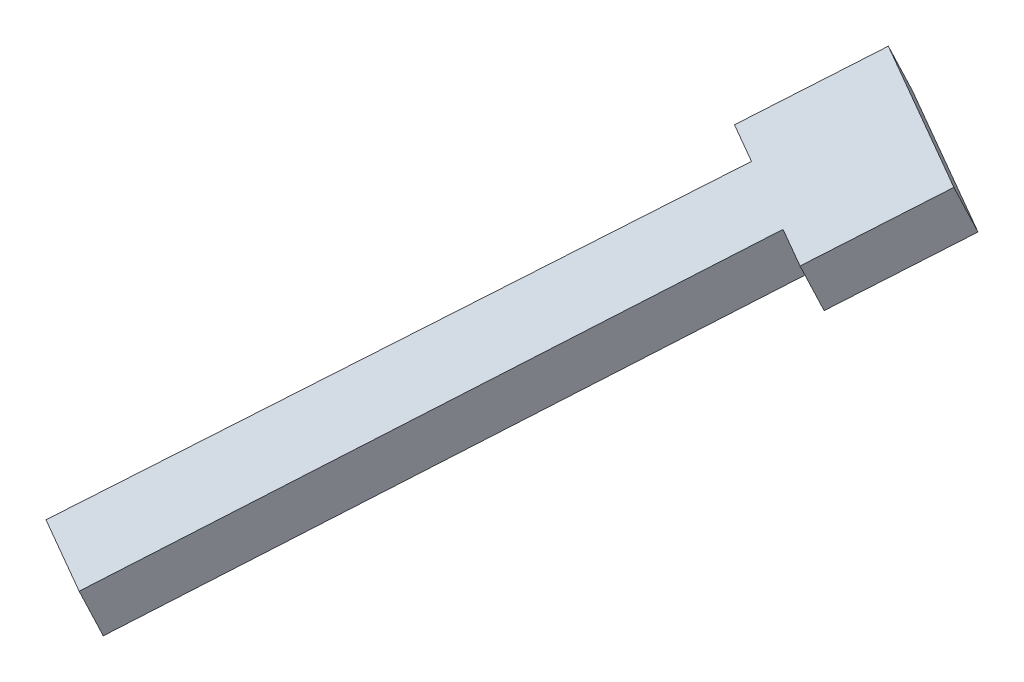
ISO-10303-21;
HEADER;
FILE_DESCRIPTION(('STEP AP214'),'2;1');
FILE_NAME('part.step','',(''),(''),'','','');
FILE_SCHEMA(('AUTOMOTIVE_DESIGN { 1 0 10303 214 1 1 1 1 }'));
ENDSEC;
DATA;
#1=APPLICATION_CONTEXT('core data for automotive mechanical design processes');
#2=APPLICATION_PROTOCOL_DEFINITION('international standard','automotive_design',2000,#1);
#3=PRODUCT_CONTEXT('',#1,'mechanical');
#4=PRODUCT('Part','Part','',(#3));
#5=PRODUCT_RELATED_PRODUCT_CATEGORY('part','',(#4));
#6=PRODUCT_DEFINITION_FORMATION('','',#4);
#7=PRODUCT_DEFINITION_CONTEXT('part definition',#1,'design');
#8=PRODUCT_DEFINITION('design','',#6,#7);
#9=PRODUCT_DEFINITION_SHAPE('','',#8);
#10=(LENGTH_UNIT() NAMED_UNIT(*) SI_UNIT(.MILLI.,.METRE.));
#11=(NAMED_UNIT(*) PLANE_ANGLE_UNIT() SI_UNIT($,.RADIAN.));
#12=(NAMED_UNIT(*) SI_UNIT($,.STERADIAN.) SOLID_ANGLE_UNIT());
#13=UNCERTAINTY_MEASURE_WITH_UNIT(LENGTH_MEASURE(1.E-05),#10,'distance_accuracy_value','');
#14=(GEOMETRIC_REPRESENTATION_CONTEXT(3) GLOBAL_UNCERTAINTY_ASSIGNED_CONTEXT((#13)) GLOBAL_UNIT_ASSIGNED_CONTEXT((#10,
#11,#12)) REPRESENTATION_CONTEXT('',''));
#15=CARTESIAN_POINT('',(0.,0.,0.));
#16=DIRECTION('',(0.,0.,1.));
#17=DIRECTION('',(1.,0.,0.));
#18=AXIS2_PLACEMENT_3D('',#15,#16,#17);
#19=CARTESIAN_POINT('',(-196.842413265264,-205.334128308447,272.802784573492));
#20=DIRECTION('',(-0.866025403782192,0.,-0.500000000003892));
#21=DIRECTION('',(-0.500000000003892,0.,0.866025403782192));
#22=AXIS2_PLACEMENT_3D('',#19,#20,#21);
#23=PLANE('',#22);
#24=DIRECTION('',(0.194220219192644,-0.921473833502283,-0.336399287495333));
#25=VECTOR('',#24,1.);
#26=CARTESIAN_POINT('',(-154.801097182227,-169.889720327231,199.985089101365));
#27=LINE('',#26,#25);
#28=CARTESIAN_POINT('',(-159.907532687323,-145.662342148101,208.829694841675));
#29=VERTEX_POINT('',#28);
#30=CARTESIAN_POINT('',(-159.130651810553,-149.34823748211,207.484097691693));
#31=VERTEX_POINT('',#30);
#32=EDGE_CURVE('E125',#29,#31,#27,.T.);
#33=ORIENTED_EDGE('',*,*,#32,.F.);
#34=DIRECTION('',(-0.460736916754728,-0.388440438382265,0.798019748733539));
#35=VECTOR('',#34,1.);
#36=CARTESIAN_POINT('',(-154.953683261378,-141.485825414326,200.24937594298));
#37=LINE('',#36,#35);
#38=CARTESIAN_POINT('',(-154.953683261378,-141.485825414326,200.24937594298));
#39=VERTEX_POINT('',#38);
#40=EDGE_CURVE('E132',#39,#29,#37,.T.);
#41=ORIENTED_EDGE('',*,*,#40,.F.);
#42=DIRECTION('',(-0.194220219192644,0.921473833502283,0.336399287495333));
#43=VECTOR('',#42,1.);
#44=CARTESIAN_POINT('',(-154.176802384607,-145.171720748335,198.903778792999));
#45=LINE('',#44,#43);
#46=CARTESIAN_POINT('',(-154.176802384607,-145.171720748335,198.903778792999));
#47=VERTEX_POINT('',#46);
#48=EDGE_CURVE('E139',#47,#39,#45,.T.);
#49=ORIENTED_EDGE('',*,*,#48,.F.);
#50=DIRECTION('',(0.460736916754728,0.388440438382265,-0.798019748733539));
#51=VECTOR('',#50,1.);
#52=CARTESIAN_POINT('',(-181.821017389891,-168.478147051271,246.784963717011));
#53=LINE('',#52,#51);
#54=EDGE_CURVE('E144',#31,#47,#53,.T.);
#55=ORIENTED_EDGE('',*,*,#54,.F.);
#56=EDGE_LOOP('',(#33,#41,#49,#55));
#57=FACE_BOUND('',#56,.T.);
#58=ADVANCED_FACE('F33',(#57),#23,.T.);
#59=CARTESIAN_POINT('',(-15.8648390061101,0.,-9.15956907092283));
#60=DIRECTION('',(0.866025403782192,0.,0.500000000003892));
#61=DIRECTION('',(0.500000000003892,0.,-0.866025403782192));
#62=AXIS2_PLACEMENT_3D('',#59,#60,#61);
#63=PLANE('',#62);
#64=DIRECTION('',(-0.194220219192644,0.921473833502283,0.336399287495333));
#65=VECTOR('',#64,1.);
#66=CARTESIAN_POINT('',(-152.660701886479,-115.330556362641,227.777815700641));
#67=LINE('',#66,#65);
#68=CARTESIAN_POINT('',(-145.490751700983,-149.34823748211,215.359097691755));
#69=VERTEX_POINT('',#68);
#70=CARTESIAN_POINT('',(-146.267632577754,-145.662342148101,216.704694841736));
#71=VERTEX_POINT('',#70);
#72=EDGE_CURVE('E102',#69,#71,#67,.T.);
#73=ORIENTED_EDGE('',*,*,#72,.F.);
#74=DIRECTION('',(0.460736916754728,0.388440438382265,-0.798019748733539));
#75=VECTOR('',#74,1.);
#76=CARTESIAN_POINT('',(-168.181117280321,-168.478147051271,254.659963717072));
#77=LINE('',#76,#75);
#78=CARTESIAN_POINT('',(-140.536902275038,-145.171720748335,206.77877879306));
#79=VERTEX_POINT('',#78);
#80=EDGE_CURVE('E130',#69,#79,#77,.T.);
#81=ORIENTED_EDGE('',*,*,#80,.T.);
#82=DIRECTION('',(-0.194220219192644,0.921473833502283,0.336399287495333));
#83=VECTOR('',#82,1.);
#84=CARTESIAN_POINT('',(-140.536902275038,-145.171720748335,206.77877879306));
#85=LINE('',#84,#83);
#86=CARTESIAN_POINT('',(-141.313783151808,-141.485825414326,208.124375943041));
#87=VERTEX_POINT('',#86);
#88=EDGE_CURVE('E129',#79,#87,#85,.T.);
#89=ORIENTED_EDGE('',*,*,#88,.T.);
#90=DIRECTION('',(-0.460736916754728,-0.388440438382265,0.798019748733539));
#91=VECTOR('',#90,1.);
#92=CARTESIAN_POINT('',(-141.313783151808,-141.485825414326,208.124375943041));
#93=LINE('',#92,#91);
#94=EDGE_CURVE('E133',#87,#71,#93,.T.);
#95=ORIENTED_EDGE('',*,*,#94,.T.);
#96=EDGE_LOOP('',(#73,#81,#89,#95));
#97=FACE_BOUND('',#96,.T.);
#98=ADVANCED_FACE('F177',(#97),#63,.T.);
#99=CARTESIAN_POINT('',(-209.448776103503,-141.485825414326,168.786619420739));
#100=DIRECTION('',(-0.194220219192644,0.921473833502283,0.336399287495333));
#101=DIRECTION('',(0.,-0.342929364412348,0.93936119305821));
#102=AXIS2_PLACEMENT_3D('',#99,#100,#101);
#103=PLANE('',#102);
#104=DIRECTION('',(-0.86602540378219,0.,-0.500000000003895));
#105=VECTOR('',#104,1.);
#106=CARTESIAN_POINT('',(-149.80496347495,-145.662342148101,214.662415896006));
#107=LINE('',#106,#105);
#108=CARTESIAN_POINT('',(-149.80496347495,-145.662342148101,214.662415896006));
#109=VERTEX_POINT('',#108);
#110=EDGE_CURVE('E96',#71,#109,#107,.T.);
#111=ORIENTED_EDGE('',*,*,#110,.F.);
#112=ORIENTED_EDGE('',*,*,#94,.F.);
#113=DIRECTION('',(0.866025403782192,0.,0.500000000003892));
#114=VECTOR('',#113,1.);
#115=CARTESIAN_POINT('',(-209.448776103503,-141.485825414326,168.786619420739));
#116=LINE('',#115,#114);
#117=EDGE_CURVE('E142',#39,#87,#116,.T.);
#118=ORIENTED_EDGE('',*,*,#117,.F.);
#119=ORIENTED_EDGE('',*,*,#40,.T.);
#120=DIRECTION('',(-0.866025403782191,0.,-0.500000000003893));
#121=VECTOR('',#120,1.);
#122=CARTESIAN_POINT('',(-156.370201790127,-145.662342148101,210.871973787405));
#123=LINE('',#122,#121);
#124=CARTESIAN_POINT('',(-156.370201790127,-145.662342148101,210.871973787405));
#125=VERTEX_POINT('',#124);
#126=EDGE_CURVE('E121',#125,#29,#123,.T.);
#127=ORIENTED_EDGE('',*,*,#126,.F.);
#128=DIRECTION('',(0.464104841659749,0.388437494912603,-0.796067213552977));
#129=VECTOR('',#128,1.);
#130=CARTESIAN_POINT('',(-179.226604088671,-164.792251717262,250.076978468193));
#131=LINE('',#130,#129);
#132=CARTESIAN_POINT('',(-179.226604088671,-164.792251717262,250.076978468193));
#133=VERTEX_POINT('',#132);
#134=EDGE_CURVE('E118',#133,#125,#131,.T.);
#135=ORIENTED_EDGE('',*,*,#134,.F.);
#136=DIRECTION('',(0.866025403782192,0.,0.500000000003892));
#137=VECTOR('',#136,1.);
#138=CARTESIAN_POINT('',(-237.092991108787,-164.792251717262,216.667804344751));
#139=LINE('',#138,#137);
#140=CARTESIAN_POINT('',(-172.329292335083,-164.792251717262,254.059143265853));
#141=VERTEX_POINT('',#140);
#142=EDGE_CURVE('E115',#133,#141,#139,.T.);
#143=ORIENTED_EDGE('',*,*,#142,.T.);
#144=DIRECTION('',(-0.457362009234086,-0.388437494912604,0.799960189669074));
#145=VECTOR('',#144,1.);
#146=CARTESIAN_POINT('',(-172.329292335083,-164.792251717262,254.059143265853));
#147=LINE('',#146,#145);
#148=EDGE_CURVE('E107',#109,#141,#147,.T.);
#149=ORIENTED_EDGE('',*,*,#148,.F.);
#150=EDGE_LOOP('',(#111,#112,#118,#119,#127,#135,#143,#149));
#151=FACE_BOUND('',#150,.T.);
#152=ADVANCED_FACE('F112',(#151),#103,.T.);
#153=CARTESIAN_POINT('',(-237.092991108787,-164.792251717262,216.667804344751));
#154=DIRECTION('',(-0.460736916754731,-0.388440438382252,0.798019748733544));
#155=DIRECTION('',(0.866025403782191,0.,0.500000000003892));
#156=AXIS2_PLACEMENT_3D('',#153,#154,#155);
#157=PLANE('',#156);
#158=DIRECTION('',(-0.194220219192645,0.921473833502283,0.336399287495333));
#159=VECTOR('',#158,1.);
#160=CARTESIAN_POINT('',(-166.866769743145,-190.709077752728,244.597776599222));
#161=LINE('',#160,#159);
#162=CARTESIAN_POINT('',(-171.552411458312,-168.478147051271,252.713546115872));
#163=VERTEX_POINT('',#162);
#164=EDGE_CURVE('E55',#163,#141,#161,.T.);
#165=ORIENTED_EDGE('',*,*,#164,.T.);
#166=ORIENTED_EDGE('',*,*,#142,.F.);
#167=DIRECTION('',(-0.194220219192645,0.921473833502283,0.336399287495333));
#168=VECTOR('',#167,1.);
#169=CARTESIAN_POINT('',(-173.764081496733,-190.709077752728,240.615611801562));
#170=LINE('',#169,#168);
#171=CARTESIAN_POINT('',(-178.4497232119,-168.478147051271,248.731381318212));
#172=VERTEX_POINT('',#171);
#173=EDGE_CURVE('E123',#172,#133,#170,.T.);
#174=ORIENTED_EDGE('',*,*,#173,.F.);
#175=DIRECTION('',(0.866025403782192,0.,0.500000000003892));
#176=VECTOR('',#175,1.);
#177=CARTESIAN_POINT('',(-236.316110232016,-168.478147051271,215.32220719477));
#178=LINE('',#177,#176);
#179=EDGE_CURVE('E146',#172,#163,#178,.T.);
#180=ORIENTED_EDGE('',*,*,#179,.T.);
#181=EDGE_LOOP('',(#165,#166,#174,#180));
#182=FACE_BOUND('',#181,.T.);
#183=ADVANCED_FACE('F168',(#182),#157,.T.);
#184=CARTESIAN_POINT('',(-236.316110232016,-168.478147051271,215.32220719477));
#185=DIRECTION('',(0.194220219192644,-0.921473833502283,-0.336399287495332));
#186=DIRECTION('',(0.,0.342929364412347,-0.93936119305821));
#187=AXIS2_PLACEMENT_3D('',#184,#185,#186);
#188=PLANE('',#187);
#189=DIRECTION('',(0.86602540378219,0.,0.500000000003895));
#190=VECTOR('',#189,1.);
#191=CARTESIAN_POINT('',(-213.625744652678,-149.34823748211,176.021341169452));
#192=LINE('',#191,#190);
#193=CARTESIAN_POINT('',(-149.028082598179,-149.34823748211,213.316818746024));
#194=VERTEX_POINT('',#193);
#195=EDGE_CURVE('E11',#194,#69,#192,.T.);
#196=ORIENTED_EDGE('',*,*,#195,.F.);
#197=DIRECTION('',(0.457362009234086,0.388437494912603,-0.799960189669075));
#198=VECTOR('',#197,1.);
#199=CARTESIAN_POINT('',(-171.419260946905,-168.365062339263,252.480655962755));
#200=LINE('',#199,#198);
#201=EDGE_CURVE('E40',#163,#194,#200,.T.);
#202=ORIENTED_EDGE('',*,*,#201,.F.);
#203=ORIENTED_EDGE('',*,*,#179,.F.);
#204=DIRECTION('',(-0.464104841659749,-0.388437494912603,0.796067213552977));
#205=VECTOR('',#204,1.);
#206=CARTESIAN_POINT('',(-178.570447200048,-168.579188280154,248.938456100087));
#207=LINE('',#206,#205);
#208=CARTESIAN_POINT('',(-155.593320913357,-149.34823748211,209.526376637423));
#209=VERTEX_POINT('',#208);
#210=EDGE_CURVE('E153',#209,#172,#207,.T.);
#211=ORIENTED_EDGE('',*,*,#210,.F.);
#212=DIRECTION('',(0.866025403782191,0.,0.500000000003893));
#213=VECTOR('',#212,1.);
#214=CARTESIAN_POINT('',(-213.625744652678,-149.34823748211,176.021341169452));
#215=LINE('',#214,#213);
#216=EDGE_CURVE('E155',#31,#209,#215,.T.);
#217=ORIENTED_EDGE('',*,*,#216,.F.);
#218=ORIENTED_EDGE('',*,*,#54,.T.);
#219=DIRECTION('',(0.866025403782192,0.,0.500000000003892));
#220=VECTOR('',#219,1.);
#221=CARTESIAN_POINT('',(-208.671895226732,-145.171720748335,167.441022270758));
#222=LINE('',#221,#220);
#223=EDGE_CURVE('E143',#47,#79,#222,.T.);
#224=ORIENTED_EDGE('',*,*,#223,.T.);
#225=ORIENTED_EDGE('',*,*,#80,.F.);
#226=EDGE_LOOP('',(#196,#202,#203,#211,#217,#218,#224,#225));
#227=FACE_BOUND('',#226,.T.);
#228=ADVANCED_FACE('F164',(#227),#188,.T.);
#229=CARTESIAN_POINT('',(-208.671895226732,-145.171720748335,167.441022270758));
#230=DIRECTION('',(0.460736916754728,0.388440438382265,-0.798019748733539));
#231=DIRECTION('',(-0.866025403782192,0.,-0.500000000003892));
#232=AXIS2_PLACEMENT_3D('',#229,#230,#231);
#233=PLANE('',#232);
#234=ORIENTED_EDGE('',*,*,#223,.F.);
#235=ORIENTED_EDGE('',*,*,#48,.T.);
#236=ORIENTED_EDGE('',*,*,#117,.T.);
#237=ORIENTED_EDGE('',*,*,#88,.F.);
#238=EDGE_LOOP('',(#234,#235,#236,#237));
#239=FACE_BOUND('',#238,.T.);
#240=ADVANCED_FACE('F175',(#239),#233,.T.);
#241=CARTESIAN_POINT('',(-150.907679198189,-171.579168183567,201.410607120773));
#242=DIRECTION('',(0.460736916754729,0.388440438382265,-0.798019748733538));
#243=DIRECTION('',(-0.866025403782191,0.,-0.500000000003893));
#244=AXIS2_PLACEMENT_3D('',#241,#242,#243);
#245=PLANE('',#244);
#246=ORIENTED_EDGE('',*,*,#32,.T.);
#247=ORIENTED_EDGE('',*,*,#216,.T.);
#248=DIRECTION('',(-0.194220219192645,0.921473833502283,0.336399287495333));
#249=VECTOR('',#248,1.);
#250=CARTESIAN_POINT('',(-150.907679198189,-171.579168183567,201.410607120773));
#251=LINE('',#250,#249);
#252=EDGE_CURVE('E47',#209,#125,#251,.T.);
#253=ORIENTED_EDGE('',*,*,#252,.T.);
#254=ORIENTED_EDGE('',*,*,#126,.T.);
#255=EDGE_LOOP('',(#246,#247,#253,#254));
#256=FACE_BOUND('',#255,.T.);
#257=ADVANCED_FACE('F159',(#256),#245,.F.);
#258=CARTESIAN_POINT('',(-173.764081496733,-190.709077752728,240.615611801562));
#259=DIRECTION('',(0.864225203523214,-0.00151218934913683,0.503102882995746));
#260=DIRECTION('',(0.503103458223597,0.,-0.86422619164398));
#261=AXIS2_PLACEMENT_3D('',#258,#259,#260);
#262=PLANE('',#261);
#263=ORIENTED_EDGE('',*,*,#210,.T.);
#264=ORIENTED_EDGE('',*,*,#173,.T.);
#265=ORIENTED_EDGE('',*,*,#134,.T.);
#266=ORIENTED_EDGE('',*,*,#252,.F.);
#267=EDGE_LOOP('',(#263,#264,#265,#266));
#268=FACE_BOUND('',#267,.T.);
#269=ADVANCED_FACE('F166',(#268),#262,.F.);
#270=CARTESIAN_POINT('',(-144.342440883012,-171.579168183567,205.201049229374));
#271=DIRECTION('',(0.460736916754731,0.388440438382265,-0.798019748733537));
#272=DIRECTION('',(-0.86602540378219,0.,-0.500000000003896));
#273=AXIS2_PLACEMENT_3D('',#270,#271,#272);
#274=PLANE('',#273);
#275=ORIENTED_EDGE('',*,*,#72,.T.);
#276=ORIENTED_EDGE('',*,*,#110,.T.);
#277=DIRECTION('',(-0.194220219192645,0.921473833502283,0.336399287495333));
#278=VECTOR('',#277,1.);
#279=CARTESIAN_POINT('',(-144.342440883012,-171.579168183567,205.201049229374));
#280=LINE('',#279,#278);
#281=EDGE_CURVE('E99',#194,#109,#280,.T.);
#282=ORIENTED_EDGE('',*,*,#281,.F.);
#283=ORIENTED_EDGE('',*,*,#195,.T.);
#284=EDGE_LOOP('',(#275,#276,#282,#283));
#285=FACE_BOUND('',#284,.T.);
#286=ADVANCED_FACE('F98',(#285),#274,.F.);
#287=CARTESIAN_POINT('',(-166.866769743145,-190.709077752728,244.597776599222));
#288=DIRECTION('',(-0.867812479148647,-0.00151218934913683,-0.496889539351807));
#289=DIRECTION('',(-0.496890107475567,0.,0.867813471370962));
#290=AXIS2_PLACEMENT_3D('',#287,#288,#289);
#291=PLANE('',#290);
#292=ORIENTED_EDGE('',*,*,#201,.T.);
#293=ORIENTED_EDGE('',*,*,#281,.T.);
#294=ORIENTED_EDGE('',*,*,#148,.T.);
#295=ORIENTED_EDGE('',*,*,#164,.F.);
#296=EDGE_LOOP('',(#292,#293,#294,#295));
#297=FACE_BOUND('',#296,.T.);
#298=ADVANCED_FACE('F109',(#297),#291,.F.);
#299=CLOSED_SHELL('',(#58,#98,#152,#183,#228,#240,#257,#269,#286,#298));
#300=MANIFOLD_SOLID_BREP('B2',#299);
#301=ADVANCED_BREP_SHAPE_REPRESENTATION('',(#18,#300),#14);
#302=SHAPE_DEFINITION_REPRESENTATION(#9,#301);
ENDSEC;
END-ISO-10303-21;
